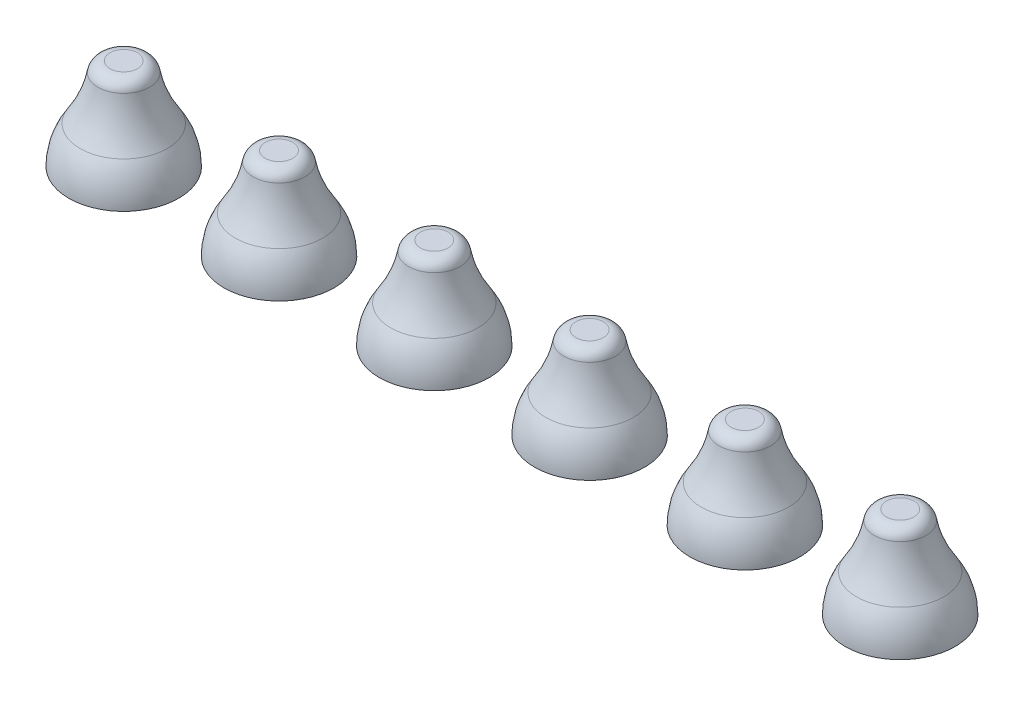
ISO-10303-21;
HEADER;
FILE_DESCRIPTION(('STEP AP214'),'2;1');
FILE_NAME('part.step','',(''),(''),'','','');
FILE_SCHEMA(('AUTOMOTIVE_DESIGN { 1 0 10303 214 1 1 1 1 }'));
ENDSEC;
DATA;
#1=APPLICATION_CONTEXT('core data for automotive mechanical design processes');
#2=APPLICATION_PROTOCOL_DEFINITION('international standard','automotive_design',2000,#1);
#3=PRODUCT_CONTEXT('',#1,'mechanical');
#4=PRODUCT('Part','Part','',(#3));
#5=PRODUCT_RELATED_PRODUCT_CATEGORY('part','',(#4));
#6=PRODUCT_DEFINITION_FORMATION('','',#4);
#7=PRODUCT_DEFINITION_CONTEXT('part definition',#1,'design');
#8=PRODUCT_DEFINITION('design','',#6,#7);
#9=PRODUCT_DEFINITION_SHAPE('','',#8);
#10=(LENGTH_UNIT() NAMED_UNIT(*) SI_UNIT(.MILLI.,.METRE.));
#11=(NAMED_UNIT(*) PLANE_ANGLE_UNIT() SI_UNIT($,.RADIAN.));
#12=(NAMED_UNIT(*) SI_UNIT($,.STERADIAN.) SOLID_ANGLE_UNIT());
#13=UNCERTAINTY_MEASURE_WITH_UNIT(LENGTH_MEASURE(1.E-05),#10,'distance_accuracy_value','');
#14=(GEOMETRIC_REPRESENTATION_CONTEXT(3) GLOBAL_UNCERTAINTY_ASSIGNED_CONTEXT((#13)) GLOBAL_UNIT_ASSIGNED_CONTEXT((#10,
#11,#12)) REPRESENTATION_CONTEXT('',''));
#15=CARTESIAN_POINT('',(0.,0.,0.));
#16=DIRECTION('',(0.,0.,1.));
#17=DIRECTION('',(1.,0.,0.));
#18=AXIS2_PLACEMENT_3D('',#15,#16,#17);
#19=CARTESIAN_POINT('',(15.24,3.1,-15.4652052931186));
#20=DIRECTION('',(0.,1.,0.));
#21=DIRECTION('',(0.,0.,1.));
#22=AXIS2_PLACEMENT_3D('',#19,#20,#21);
#23=PLANE('',#22);
#24=CARTESIAN_POINT('',(15.24,3.1,-15.24));
#25=DIRECTION('',(0.,-1.,0.));
#26=DIRECTION('',(0.,0.,-1.));
#27=AXIS2_PLACEMENT_3D('',#24,#25,#26);
#28=CIRCLE('',#27,0.225205293118592);
#29=CARTESIAN_POINT('',(15.24,3.1,-15.4652052931186));
#30=VERTEX_POINT('',#29);
#31=EDGE_CURVE('P0_E31',#30,#30,#28,.T.);
#32=ORIENTED_EDGE('',*,*,#31,.F.);
#33=EDGE_LOOP('',(#32));
#34=FACE_BOUND('',#33,.T.);
#35=ADVANCED_FACE('P0_F15',(#34),#23,.T.);
#36=CARTESIAN_POINT('',(15.24,2.9,-15.24));
#37=DIRECTION('',(0.,-1.,0.));
#38=DIRECTION('',(0.,0.,-1.));
#39=AXIS2_PLACEMENT_3D('',#36,#37,#38);
#40=TOROIDAL_SURFACE('',#39,0.225205293118592,0.2);
#41=ORIENTED_EDGE('',*,*,#31,.T.);
#42=EDGE_LOOP('',(#41));
#43=FACE_BOUND('',#42,.T.);
#44=CARTESIAN_POINT('',(15.24,2.9352099302314,-15.24));
#45=DIRECTION('',(0.,-1.,0.));
#46=DIRECTION('',(0.,0.,-1.));
#47=AXIS2_PLACEMENT_3D('',#44,#45,#46);
#48=CIRCLE('',#47,0.422081550735146);
#49=CARTESIAN_POINT('',(15.24,2.9352099302314,-15.6620815507351));
#50=VERTEX_POINT('',#49);
#51=EDGE_CURVE('P0_E26',#50,#50,#48,.T.);
#52=ORIENTED_EDGE('',*,*,#51,.F.);
#53=EDGE_LOOP('',(#52));
#54=FACE_BOUND('',#53,.T.);
#55=ADVANCED_FACE('P0_F36',(#43,#54),#40,.T.);
#56=CARTESIAN_POINT('',(15.24,3.2697042674297,-15.24));
#57=DIRECTION('',(0.,-1.,0.));
#58=DIRECTION('',(0.,0.,-1.));
#59=AXIS2_PLACEMENT_3D('',#56,#57,#58);
#60=TOROIDAL_SURFACE('',#59,2.29240599809241,1.9);
#61=ORIENTED_EDGE('',*,*,#51,.T.);
#62=EDGE_LOOP('',(#61));
#63=FACE_BOUND('',#62,.T.);
#64=CARTESIAN_POINT('',(15.24,2.21222489805755,-15.24));
#65=DIRECTION('',(0.,-1.,0.));
#66=DIRECTION('',(0.,0.,-1.));
#67=AXIS2_PLACEMENT_3D('',#64,#65,#66);
#68=CIRCLE('',#67,0.713882199300552);
#69=CARTESIAN_POINT('',(15.24,2.21222489805755,-15.9538821993006));
#70=VERTEX_POINT('',#69);
#71=EDGE_CURVE('P0_E22',#70,#70,#68,.T.);
#72=ORIENTED_EDGE('',*,*,#71,.F.);
#73=EDGE_LOOP('',(#72));
#74=FACE_BOUND('',#73,.T.);
#75=ADVANCED_FACE('P0_F45',(#63,#74),#60,.F.);
#76=CARTESIAN_POINT('',(15.24,1.6,-15.24));
#77=DIRECTION('',(0.,-1.,0.));
#78=DIRECTION('',(0.,0.,-1.));
#79=AXIS2_PLACEMENT_3D('',#76,#77,#78);
#80=DEGENERATE_TOROIDAL_SURFACE('',#79,0.2,1.1,.F.);
#81=CARTESIAN_POINT('',(15.24,1.601,-15.24));
#82=DIRECTION('',(0.,1.,0.));
#83=DIRECTION('',(0.,0.,1.));
#84=AXIS2_PLACEMENT_3D('',#81,#82,#83);
#85=CIRCLE('',#84,0.899999545454451);
#86=CARTESIAN_POINT('',(15.24,1.601,-14.3400004545455));
#87=VERTEX_POINT('',#86);
#88=EDGE_CURVE('P0_E10',#87,#87,#85,.F.);
#89=ORIENTED_EDGE('',*,*,#88,.F.);
#90=EDGE_LOOP('',(#89));
#91=FACE_BOUND('',#90,.T.);
#92=ORIENTED_EDGE('',*,*,#71,.T.);
#93=EDGE_LOOP('',(#92));
#94=FACE_BOUND('',#93,.T.);
#95=ADVANCED_FACE('P0_F50',(#91,#94),#80,.F.);
#96=CARTESIAN_POINT('',(39.38,1.601,3.38));
#97=DIRECTION('',(0.,1.,0.));
#98=DIRECTION('',(0.,0.,1.));
#99=AXIS2_PLACEMENT_3D('',#96,#97,#98);
#100=PLANE('',#99);
#101=ORIENTED_EDGE('',*,*,#88,.T.);
#102=EDGE_LOOP('',(#101));
#103=FACE_BOUND('',#102,.T.);
#104=ADVANCED_FACE('P0_F17',(#103),#100,.F.);
#105=CLOSED_SHELL('',(#35,#55,#75,#95,#104));
#106=MANIFOLD_SOLID_BREP('P0_B1',#105);
#107=CARTESIAN_POINT('',(17.78,3.1,-15.4652052931186));
#108=DIRECTION('',(0.,1.,0.));
#109=DIRECTION('',(0.,0.,1.));
#110=AXIS2_PLACEMENT_3D('',#107,#108,#109);
#111=PLANE('',#110);
#112=CARTESIAN_POINT('',(17.78,3.1,-15.24));
#113=DIRECTION('',(0.,-1.,0.));
#114=DIRECTION('',(0.,0.,-1.));
#115=AXIS2_PLACEMENT_3D('',#112,#113,#114);
#116=CIRCLE('',#115,0.225205293118592);
#117=CARTESIAN_POINT('',(17.78,3.1,-15.4652052931186));
#118=VERTEX_POINT('',#117);
#119=EDGE_CURVE('P1_E31',#118,#118,#116,.T.);
#120=ORIENTED_EDGE('',*,*,#119,.F.);
#121=EDGE_LOOP('',(#120));
#122=FACE_BOUND('',#121,.T.);
#123=ADVANCED_FACE('P1_F15',(#122),#111,.T.);
#124=CARTESIAN_POINT('',(17.78,2.9,-15.24));
#125=DIRECTION('',(0.,-1.,0.));
#126=DIRECTION('',(0.,0.,-1.));
#127=AXIS2_PLACEMENT_3D('',#124,#125,#126);
#128=TOROIDAL_SURFACE('',#127,0.225205293118592,0.2);
#129=ORIENTED_EDGE('',*,*,#119,.T.);
#130=EDGE_LOOP('',(#129));
#131=FACE_BOUND('',#130,.T.);
#132=CARTESIAN_POINT('',(17.78,2.9352099302314,-15.24));
#133=DIRECTION('',(0.,-1.,0.));
#134=DIRECTION('',(0.,0.,-1.));
#135=AXIS2_PLACEMENT_3D('',#132,#133,#134);
#136=CIRCLE('',#135,0.422081550735146);
#137=CARTESIAN_POINT('',(17.78,2.9352099302314,-15.6620815507351));
#138=VERTEX_POINT('',#137);
#139=EDGE_CURVE('P1_E26',#138,#138,#136,.T.);
#140=ORIENTED_EDGE('',*,*,#139,.F.);
#141=EDGE_LOOP('',(#140));
#142=FACE_BOUND('',#141,.T.);
#143=ADVANCED_FACE('P1_F36',(#131,#142),#128,.T.);
#144=CARTESIAN_POINT('',(17.78,3.2697042674297,-15.24));
#145=DIRECTION('',(0.,-1.,0.));
#146=DIRECTION('',(0.,0.,-1.));
#147=AXIS2_PLACEMENT_3D('',#144,#145,#146);
#148=TOROIDAL_SURFACE('',#147,2.29240599809241,1.9);
#149=ORIENTED_EDGE('',*,*,#139,.T.);
#150=EDGE_LOOP('',(#149));
#151=FACE_BOUND('',#150,.T.);
#152=CARTESIAN_POINT('',(17.78,2.21222489805755,-15.24));
#153=DIRECTION('',(0.,-1.,0.));
#154=DIRECTION('',(0.,0.,-1.));
#155=AXIS2_PLACEMENT_3D('',#152,#153,#154);
#156=CIRCLE('',#155,0.713882199300552);
#157=CARTESIAN_POINT('',(17.78,2.21222489805755,-15.9538821993006));
#158=VERTEX_POINT('',#157);
#159=EDGE_CURVE('P1_E22',#158,#158,#156,.T.);
#160=ORIENTED_EDGE('',*,*,#159,.F.);
#161=EDGE_LOOP('',(#160));
#162=FACE_BOUND('',#161,.T.);
#163=ADVANCED_FACE('P1_F45',(#151,#162),#148,.F.);
#164=CARTESIAN_POINT('',(17.78,1.6,-15.24));
#165=DIRECTION('',(0.,-1.,0.));
#166=DIRECTION('',(0.,0.,-1.));
#167=AXIS2_PLACEMENT_3D('',#164,#165,#166);
#168=DEGENERATE_TOROIDAL_SURFACE('',#167,0.2,1.1,.F.);
#169=CARTESIAN_POINT('',(17.78,1.601,-15.24));
#170=DIRECTION('',(0.,1.,0.));
#171=DIRECTION('',(0.,0.,1.));
#172=AXIS2_PLACEMENT_3D('',#169,#170,#171);
#173=CIRCLE('',#172,0.899999545454451);
#174=CARTESIAN_POINT('',(17.78,1.601,-14.3400004545455));
#175=VERTEX_POINT('',#174);
#176=EDGE_CURVE('P1_E10',#175,#175,#173,.F.);
#177=ORIENTED_EDGE('',*,*,#176,.F.);
#178=EDGE_LOOP('',(#177));
#179=FACE_BOUND('',#178,.T.);
#180=ORIENTED_EDGE('',*,*,#159,.T.);
#181=EDGE_LOOP('',(#180));
#182=FACE_BOUND('',#181,.T.);
#183=ADVANCED_FACE('P1_F50',(#179,#182),#168,.F.);
#184=CARTESIAN_POINT('',(39.38,1.601,3.38));
#185=DIRECTION('',(0.,1.,0.));
#186=DIRECTION('',(0.,0.,1.));
#187=AXIS2_PLACEMENT_3D('',#184,#185,#186);
#188=PLANE('',#187);
#189=ORIENTED_EDGE('',*,*,#176,.T.);
#190=EDGE_LOOP('',(#189));
#191=FACE_BOUND('',#190,.T.);
#192=ADVANCED_FACE('P1_F17',(#191),#188,.F.);
#193=CLOSED_SHELL('',(#123,#143,#163,#183,#192));
#194=MANIFOLD_SOLID_BREP('P1_B1',#193);
#195=CARTESIAN_POINT('',(20.32,3.1,-15.4652052931186));
#196=DIRECTION('',(0.,1.,0.));
#197=DIRECTION('',(0.,0.,1.));
#198=AXIS2_PLACEMENT_3D('',#195,#196,#197);
#199=PLANE('',#198);
#200=CARTESIAN_POINT('',(20.32,3.1,-15.24));
#201=DIRECTION('',(0.,-1.,0.));
#202=DIRECTION('',(0.,0.,-1.));
#203=AXIS2_PLACEMENT_3D('',#200,#201,#202);
#204=CIRCLE('',#203,0.225205293118592);
#205=CARTESIAN_POINT('',(20.32,3.1,-15.4652052931186));
#206=VERTEX_POINT('',#205);
#207=EDGE_CURVE('P2_E31',#206,#206,#204,.T.);
#208=ORIENTED_EDGE('',*,*,#207,.F.);
#209=EDGE_LOOP('',(#208));
#210=FACE_BOUND('',#209,.T.);
#211=ADVANCED_FACE('P2_F15',(#210),#199,.T.);
#212=CARTESIAN_POINT('',(20.32,2.9,-15.24));
#213=DIRECTION('',(0.,-1.,0.));
#214=DIRECTION('',(0.,0.,-1.));
#215=AXIS2_PLACEMENT_3D('',#212,#213,#214);
#216=TOROIDAL_SURFACE('',#215,0.225205293118592,0.2);
#217=ORIENTED_EDGE('',*,*,#207,.T.);
#218=EDGE_LOOP('',(#217));
#219=FACE_BOUND('',#218,.T.);
#220=CARTESIAN_POINT('',(20.32,2.9352099302314,-15.24));
#221=DIRECTION('',(0.,-1.,0.));
#222=DIRECTION('',(0.,0.,-1.));
#223=AXIS2_PLACEMENT_3D('',#220,#221,#222);
#224=CIRCLE('',#223,0.422081550735146);
#225=CARTESIAN_POINT('',(20.32,2.9352099302314,-15.6620815507351));
#226=VERTEX_POINT('',#225);
#227=EDGE_CURVE('P2_E26',#226,#226,#224,.T.);
#228=ORIENTED_EDGE('',*,*,#227,.F.);
#229=EDGE_LOOP('',(#228));
#230=FACE_BOUND('',#229,.T.);
#231=ADVANCED_FACE('P2_F36',(#219,#230),#216,.T.);
#232=CARTESIAN_POINT('',(20.32,3.2697042674297,-15.24));
#233=DIRECTION('',(0.,-1.,0.));
#234=DIRECTION('',(0.,0.,-1.));
#235=AXIS2_PLACEMENT_3D('',#232,#233,#234);
#236=TOROIDAL_SURFACE('',#235,2.29240599809241,1.9);
#237=ORIENTED_EDGE('',*,*,#227,.T.);
#238=EDGE_LOOP('',(#237));
#239=FACE_BOUND('',#238,.T.);
#240=CARTESIAN_POINT('',(20.32,2.21222489805755,-15.24));
#241=DIRECTION('',(0.,-1.,0.));
#242=DIRECTION('',(0.,0.,-1.));
#243=AXIS2_PLACEMENT_3D('',#240,#241,#242);
#244=CIRCLE('',#243,0.713882199300552);
#245=CARTESIAN_POINT('',(20.32,2.21222489805755,-15.9538821993006));
#246=VERTEX_POINT('',#245);
#247=EDGE_CURVE('P2_E22',#246,#246,#244,.T.);
#248=ORIENTED_EDGE('',*,*,#247,.F.);
#249=EDGE_LOOP('',(#248));
#250=FACE_BOUND('',#249,.T.);
#251=ADVANCED_FACE('P2_F45',(#239,#250),#236,.F.);
#252=CARTESIAN_POINT('',(20.32,1.6,-15.24));
#253=DIRECTION('',(0.,-1.,0.));
#254=DIRECTION('',(0.,0.,-1.));
#255=AXIS2_PLACEMENT_3D('',#252,#253,#254);
#256=DEGENERATE_TOROIDAL_SURFACE('',#255,0.2,1.1,.F.);
#257=CARTESIAN_POINT('',(20.32,1.601,-15.24));
#258=DIRECTION('',(0.,1.,0.));
#259=DIRECTION('',(0.,0.,1.));
#260=AXIS2_PLACEMENT_3D('',#257,#258,#259);
#261=CIRCLE('',#260,0.899999545454451);
#262=CARTESIAN_POINT('',(20.32,1.601,-14.3400004545455));
#263=VERTEX_POINT('',#262);
#264=EDGE_CURVE('P2_E10',#263,#263,#261,.F.);
#265=ORIENTED_EDGE('',*,*,#264,.F.);
#266=EDGE_LOOP('',(#265));
#267=FACE_BOUND('',#266,.T.);
#268=ORIENTED_EDGE('',*,*,#247,.T.);
#269=EDGE_LOOP('',(#268));
#270=FACE_BOUND('',#269,.T.);
#271=ADVANCED_FACE('P2_F50',(#267,#270),#256,.F.);
#272=CARTESIAN_POINT('',(39.38,1.601,3.38));
#273=DIRECTION('',(0.,1.,0.));
#274=DIRECTION('',(0.,0.,1.));
#275=AXIS2_PLACEMENT_3D('',#272,#273,#274);
#276=PLANE('',#275);
#277=ORIENTED_EDGE('',*,*,#264,.T.);
#278=EDGE_LOOP('',(#277));
#279=FACE_BOUND('',#278,.T.);
#280=ADVANCED_FACE('P2_F17',(#279),#276,.F.);
#281=CLOSED_SHELL('',(#211,#231,#251,#271,#280));
#282=MANIFOLD_SOLID_BREP('P2_B1',#281);
#283=CARTESIAN_POINT('',(10.16,3.1,-15.4652052931186));
#284=DIRECTION('',(0.,1.,0.));
#285=DIRECTION('',(0.,0.,1.));
#286=AXIS2_PLACEMENT_3D('',#283,#284,#285);
#287=PLANE('',#286);
#288=CARTESIAN_POINT('',(10.16,3.1,-15.24));
#289=DIRECTION('',(0.,-1.,0.));
#290=DIRECTION('',(0.,0.,-1.));
#291=AXIS2_PLACEMENT_3D('',#288,#289,#290);
#292=CIRCLE('',#291,0.225205293118592);
#293=CARTESIAN_POINT('',(10.16,3.1,-15.4652052931186));
#294=VERTEX_POINT('',#293);
#295=EDGE_CURVE('P3_E31',#294,#294,#292,.T.);
#296=ORIENTED_EDGE('',*,*,#295,.F.);
#297=EDGE_LOOP('',(#296));
#298=FACE_BOUND('',#297,.T.);
#299=ADVANCED_FACE('P3_F15',(#298),#287,.T.);
#300=CARTESIAN_POINT('',(10.16,2.9,-15.24));
#301=DIRECTION('',(0.,-1.,0.));
#302=DIRECTION('',(0.,0.,-1.));
#303=AXIS2_PLACEMENT_3D('',#300,#301,#302);
#304=TOROIDAL_SURFACE('',#303,0.225205293118592,0.2);
#305=ORIENTED_EDGE('',*,*,#295,.T.);
#306=EDGE_LOOP('',(#305));
#307=FACE_BOUND('',#306,.T.);
#308=CARTESIAN_POINT('',(10.16,2.9352099302314,-15.24));
#309=DIRECTION('',(0.,-1.,0.));
#310=DIRECTION('',(0.,0.,-1.));
#311=AXIS2_PLACEMENT_3D('',#308,#309,#310);
#312=CIRCLE('',#311,0.422081550735146);
#313=CARTESIAN_POINT('',(10.16,2.9352099302314,-15.6620815507351));
#314=VERTEX_POINT('',#313);
#315=EDGE_CURVE('P3_E26',#314,#314,#312,.T.);
#316=ORIENTED_EDGE('',*,*,#315,.F.);
#317=EDGE_LOOP('',(#316));
#318=FACE_BOUND('',#317,.T.);
#319=ADVANCED_FACE('P3_F36',(#307,#318),#304,.T.);
#320=CARTESIAN_POINT('',(10.16,3.2697042674297,-15.24));
#321=DIRECTION('',(0.,-1.,0.));
#322=DIRECTION('',(0.,0.,-1.));
#323=AXIS2_PLACEMENT_3D('',#320,#321,#322);
#324=TOROIDAL_SURFACE('',#323,2.29240599809241,1.9);
#325=ORIENTED_EDGE('',*,*,#315,.T.);
#326=EDGE_LOOP('',(#325));
#327=FACE_BOUND('',#326,.T.);
#328=CARTESIAN_POINT('',(10.16,2.21222489805755,-15.24));
#329=DIRECTION('',(0.,-1.,0.));
#330=DIRECTION('',(0.,0.,-1.));
#331=AXIS2_PLACEMENT_3D('',#328,#329,#330);
#332=CIRCLE('',#331,0.713882199300552);
#333=CARTESIAN_POINT('',(10.16,2.21222489805755,-15.9538821993006));
#334=VERTEX_POINT('',#333);
#335=EDGE_CURVE('P3_E22',#334,#334,#332,.T.);
#336=ORIENTED_EDGE('',*,*,#335,.F.);
#337=EDGE_LOOP('',(#336));
#338=FACE_BOUND('',#337,.T.);
#339=ADVANCED_FACE('P3_F45',(#327,#338),#324,.F.);
#340=CARTESIAN_POINT('',(10.16,1.6,-15.24));
#341=DIRECTION('',(0.,-1.,0.));
#342=DIRECTION('',(0.,0.,-1.));
#343=AXIS2_PLACEMENT_3D('',#340,#341,#342);
#344=DEGENERATE_TOROIDAL_SURFACE('',#343,0.2,1.1,.F.);
#345=CARTESIAN_POINT('',(10.16,1.601,-15.24));
#346=DIRECTION('',(0.,1.,0.));
#347=DIRECTION('',(0.,0.,1.));
#348=AXIS2_PLACEMENT_3D('',#345,#346,#347);
#349=CIRCLE('',#348,0.899999545454451);
#350=CARTESIAN_POINT('',(10.16,1.601,-14.3400004545455));
#351=VERTEX_POINT('',#350);
#352=EDGE_CURVE('P3_E10',#351,#351,#349,.F.);
#353=ORIENTED_EDGE('',*,*,#352,.F.);
#354=EDGE_LOOP('',(#353));
#355=FACE_BOUND('',#354,.T.);
#356=ORIENTED_EDGE('',*,*,#335,.T.);
#357=EDGE_LOOP('',(#356));
#358=FACE_BOUND('',#357,.T.);
#359=ADVANCED_FACE('P3_F50',(#355,#358),#344,.F.);
#360=CARTESIAN_POINT('',(39.38,1.601,3.38));
#361=DIRECTION('',(0.,1.,0.));
#362=DIRECTION('',(0.,0.,1.));
#363=AXIS2_PLACEMENT_3D('',#360,#361,#362);
#364=PLANE('',#363);
#365=ORIENTED_EDGE('',*,*,#352,.T.);
#366=EDGE_LOOP('',(#365));
#367=FACE_BOUND('',#366,.T.);
#368=ADVANCED_FACE('P3_F17',(#367),#364,.F.);
#369=CLOSED_SHELL('',(#299,#319,#339,#359,#368));
#370=MANIFOLD_SOLID_BREP('P3_B1',#369);
#371=CARTESIAN_POINT('',(7.62,3.1,-15.4652052931186));
#372=DIRECTION('',(0.,1.,0.));
#373=DIRECTION('',(0.,0.,1.));
#374=AXIS2_PLACEMENT_3D('',#371,#372,#373);
#375=PLANE('',#374);
#376=CARTESIAN_POINT('',(7.62,3.1,-15.24));
#377=DIRECTION('',(0.,-1.,0.));
#378=DIRECTION('',(0.,0.,-1.));
#379=AXIS2_PLACEMENT_3D('',#376,#377,#378);
#380=CIRCLE('',#379,0.225205293118592);
#381=CARTESIAN_POINT('',(7.62,3.1,-15.4652052931186));
#382=VERTEX_POINT('',#381);
#383=EDGE_CURVE('P4_E31',#382,#382,#380,.T.);
#384=ORIENTED_EDGE('',*,*,#383,.F.);
#385=EDGE_LOOP('',(#384));
#386=FACE_BOUND('',#385,.T.);
#387=ADVANCED_FACE('P4_F15',(#386),#375,.T.);
#388=CARTESIAN_POINT('',(7.62,2.9,-15.24));
#389=DIRECTION('',(0.,-1.,0.));
#390=DIRECTION('',(0.,0.,-1.));
#391=AXIS2_PLACEMENT_3D('',#388,#389,#390);
#392=TOROIDAL_SURFACE('',#391,0.225205293118592,0.2);
#393=ORIENTED_EDGE('',*,*,#383,.T.);
#394=EDGE_LOOP('',(#393));
#395=FACE_BOUND('',#394,.T.);
#396=CARTESIAN_POINT('',(7.62,2.9352099302314,-15.24));
#397=DIRECTION('',(0.,-1.,0.));
#398=DIRECTION('',(0.,0.,-1.));
#399=AXIS2_PLACEMENT_3D('',#396,#397,#398);
#400=CIRCLE('',#399,0.422081550735146);
#401=CARTESIAN_POINT('',(7.62,2.9352099302314,-15.6620815507351));
#402=VERTEX_POINT('',#401);
#403=EDGE_CURVE('P4_E26',#402,#402,#400,.T.);
#404=ORIENTED_EDGE('',*,*,#403,.F.);
#405=EDGE_LOOP('',(#404));
#406=FACE_BOUND('',#405,.T.);
#407=ADVANCED_FACE('P4_F36',(#395,#406),#392,.T.);
#408=CARTESIAN_POINT('',(7.62,3.2697042674297,-15.24));
#409=DIRECTION('',(0.,-1.,0.));
#410=DIRECTION('',(0.,0.,-1.));
#411=AXIS2_PLACEMENT_3D('',#408,#409,#410);
#412=TOROIDAL_SURFACE('',#411,2.29240599809241,1.9);
#413=ORIENTED_EDGE('',*,*,#403,.T.);
#414=EDGE_LOOP('',(#413));
#415=FACE_BOUND('',#414,.T.);
#416=CARTESIAN_POINT('',(7.62,2.21222489805755,-15.24));
#417=DIRECTION('',(0.,-1.,0.));
#418=DIRECTION('',(0.,0.,-1.));
#419=AXIS2_PLACEMENT_3D('',#416,#417,#418);
#420=CIRCLE('',#419,0.713882199300552);
#421=CARTESIAN_POINT('',(7.62,2.21222489805755,-15.9538821993006));
#422=VERTEX_POINT('',#421);
#423=EDGE_CURVE('P4_E22',#422,#422,#420,.T.);
#424=ORIENTED_EDGE('',*,*,#423,.F.);
#425=EDGE_LOOP('',(#424));
#426=FACE_BOUND('',#425,.T.);
#427=ADVANCED_FACE('P4_F45',(#415,#426),#412,.F.);
#428=CARTESIAN_POINT('',(7.62,1.6,-15.24));
#429=DIRECTION('',(0.,-1.,0.));
#430=DIRECTION('',(0.,0.,-1.));
#431=AXIS2_PLACEMENT_3D('',#428,#429,#430);
#432=DEGENERATE_TOROIDAL_SURFACE('',#431,0.2,1.1,.F.);
#433=CARTESIAN_POINT('',(7.62,1.601,-15.24));
#434=DIRECTION('',(0.,1.,0.));
#435=DIRECTION('',(0.,0.,1.));
#436=AXIS2_PLACEMENT_3D('',#433,#434,#435);
#437=CIRCLE('',#436,0.899999545454451);
#438=CARTESIAN_POINT('',(7.62,1.601,-14.3400004545455));
#439=VERTEX_POINT('',#438);
#440=EDGE_CURVE('P4_E10',#439,#439,#437,.F.);
#441=ORIENTED_EDGE('',*,*,#440,.F.);
#442=EDGE_LOOP('',(#441));
#443=FACE_BOUND('',#442,.T.);
#444=ORIENTED_EDGE('',*,*,#423,.T.);
#445=EDGE_LOOP('',(#444));
#446=FACE_BOUND('',#445,.T.);
#447=ADVANCED_FACE('P4_F50',(#443,#446),#432,.F.);
#448=CARTESIAN_POINT('',(39.38,1.601,3.38));
#449=DIRECTION('',(0.,1.,0.));
#450=DIRECTION('',(0.,0.,1.));
#451=AXIS2_PLACEMENT_3D('',#448,#449,#450);
#452=PLANE('',#451);
#453=ORIENTED_EDGE('',*,*,#440,.T.);
#454=EDGE_LOOP('',(#453));
#455=FACE_BOUND('',#454,.T.);
#456=ADVANCED_FACE('P4_F17',(#455),#452,.F.);
#457=CLOSED_SHELL('',(#387,#407,#427,#447,#456));
#458=MANIFOLD_SOLID_BREP('P4_B1',#457);
#459=CARTESIAN_POINT('',(12.7,3.1,-15.4652052931186));
#460=DIRECTION('',(0.,1.,0.));
#461=DIRECTION('',(0.,0.,1.));
#462=AXIS2_PLACEMENT_3D('',#459,#460,#461);
#463=PLANE('',#462);
#464=CARTESIAN_POINT('',(12.7,3.1,-15.24));
#465=DIRECTION('',(0.,-1.,0.));
#466=DIRECTION('',(0.,0.,-1.));
#467=AXIS2_PLACEMENT_3D('',#464,#465,#466);
#468=CIRCLE('',#467,0.225205293118592);
#469=CARTESIAN_POINT('',(12.7,3.1,-15.4652052931186));
#470=VERTEX_POINT('',#469);
#471=EDGE_CURVE('P5_E31',#470,#470,#468,.T.);
#472=ORIENTED_EDGE('',*,*,#471,.F.);
#473=EDGE_LOOP('',(#472));
#474=FACE_BOUND('',#473,.T.);
#475=ADVANCED_FACE('P5_F15',(#474),#463,.T.);
#476=CARTESIAN_POINT('',(12.7,2.9,-15.24));
#477=DIRECTION('',(0.,-1.,0.));
#478=DIRECTION('',(0.,0.,-1.));
#479=AXIS2_PLACEMENT_3D('',#476,#477,#478);
#480=TOROIDAL_SURFACE('',#479,0.225205293118592,0.2);
#481=ORIENTED_EDGE('',*,*,#471,.T.);
#482=EDGE_LOOP('',(#481));
#483=FACE_BOUND('',#482,.T.);
#484=CARTESIAN_POINT('',(12.7,2.9352099302314,-15.24));
#485=DIRECTION('',(0.,-1.,0.));
#486=DIRECTION('',(0.,0.,-1.));
#487=AXIS2_PLACEMENT_3D('',#484,#485,#486);
#488=CIRCLE('',#487,0.422081550735146);
#489=CARTESIAN_POINT('',(12.7,2.9352099302314,-15.6620815507351));
#490=VERTEX_POINT('',#489);
#491=EDGE_CURVE('P5_E26',#490,#490,#488,.T.);
#492=ORIENTED_EDGE('',*,*,#491,.F.);
#493=EDGE_LOOP('',(#492));
#494=FACE_BOUND('',#493,.T.);
#495=ADVANCED_FACE('P5_F36',(#483,#494),#480,.T.);
#496=CARTESIAN_POINT('',(12.7,3.2697042674297,-15.24));
#497=DIRECTION('',(0.,-1.,0.));
#498=DIRECTION('',(0.,0.,-1.));
#499=AXIS2_PLACEMENT_3D('',#496,#497,#498);
#500=TOROIDAL_SURFACE('',#499,2.29240599809241,1.9);
#501=ORIENTED_EDGE('',*,*,#491,.T.);
#502=EDGE_LOOP('',(#501));
#503=FACE_BOUND('',#502,.T.);
#504=CARTESIAN_POINT('',(12.7,2.21222489805755,-15.24));
#505=DIRECTION('',(0.,-1.,0.));
#506=DIRECTION('',(0.,0.,-1.));
#507=AXIS2_PLACEMENT_3D('',#504,#505,#506);
#508=CIRCLE('',#507,0.713882199300552);
#509=CARTESIAN_POINT('',(12.7,2.21222489805755,-15.9538821993006));
#510=VERTEX_POINT('',#509);
#511=EDGE_CURVE('P5_E22',#510,#510,#508,.T.);
#512=ORIENTED_EDGE('',*,*,#511,.F.);
#513=EDGE_LOOP('',(#512));
#514=FACE_BOUND('',#513,.T.);
#515=ADVANCED_FACE('P5_F45',(#503,#514),#500,.F.);
#516=CARTESIAN_POINT('',(12.7,1.6,-15.24));
#517=DIRECTION('',(0.,-1.,0.));
#518=DIRECTION('',(0.,0.,-1.));
#519=AXIS2_PLACEMENT_3D('',#516,#517,#518);
#520=DEGENERATE_TOROIDAL_SURFACE('',#519,0.2,1.1,.F.);
#521=CARTESIAN_POINT('',(12.7,1.601,-15.24));
#522=DIRECTION('',(0.,1.,0.));
#523=DIRECTION('',(0.,0.,1.));
#524=AXIS2_PLACEMENT_3D('',#521,#522,#523);
#525=CIRCLE('',#524,0.899999545454451);
#526=CARTESIAN_POINT('',(12.7,1.601,-14.3400004545455));
#527=VERTEX_POINT('',#526);
#528=EDGE_CURVE('P5_E10',#527,#527,#525,.F.);
#529=ORIENTED_EDGE('',*,*,#528,.F.);
#530=EDGE_LOOP('',(#529));
#531=FACE_BOUND('',#530,.T.);
#532=ORIENTED_EDGE('',*,*,#511,.T.);
#533=EDGE_LOOP('',(#532));
#534=FACE_BOUND('',#533,.T.);
#535=ADVANCED_FACE('P5_F50',(#531,#534),#520,.F.);
#536=CARTESIAN_POINT('',(39.38,1.601,3.38));
#537=DIRECTION('',(0.,1.,0.));
#538=DIRECTION('',(0.,0.,1.));
#539=AXIS2_PLACEMENT_3D('',#536,#537,#538);
#540=PLANE('',#539);
#541=ORIENTED_EDGE('',*,*,#528,.T.);
#542=EDGE_LOOP('',(#541));
#543=FACE_BOUND('',#542,.T.);
#544=ADVANCED_FACE('P5_F17',(#543),#540,.F.);
#545=CLOSED_SHELL('',(#475,#495,#515,#535,#544));
#546=MANIFOLD_SOLID_BREP('P5_B1',#545);
#547=ADVANCED_BREP_SHAPE_REPRESENTATION('',(#18,#106,#194,#282,#370,#458,#546),#14);
#548=SHAPE_DEFINITION_REPRESENTATION(#9,#547);
ENDSEC;
END-ISO-10303-21;
